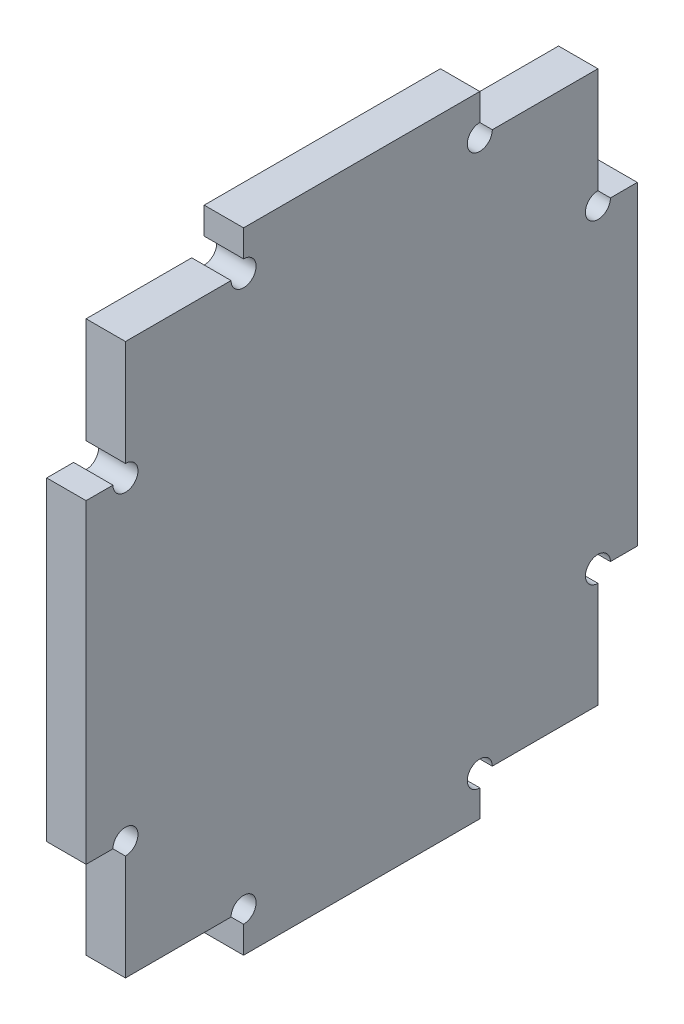
ISO-10303-21;
HEADER;
FILE_DESCRIPTION(('STEP AP214'),'2;1');
FILE_NAME('part.step','',(''),(''),'','','');
FILE_SCHEMA(('AUTOMOTIVE_DESIGN { 1 0 10303 214 1 1 1 1 }'));
ENDSEC;
DATA;
#1=APPLICATION_CONTEXT('core data for automotive mechanical design processes');
#2=APPLICATION_PROTOCOL_DEFINITION('international standard','automotive_design',2000,#1);
#3=PRODUCT_CONTEXT('',#1,'mechanical');
#4=PRODUCT('Part','Part','',(#3));
#5=PRODUCT_RELATED_PRODUCT_CATEGORY('part','',(#4));
#6=PRODUCT_DEFINITION_FORMATION('','',#4);
#7=PRODUCT_DEFINITION_CONTEXT('part definition',#1,'design');
#8=PRODUCT_DEFINITION('design','',#6,#7);
#9=PRODUCT_DEFINITION_SHAPE('','',#8);
#10=(LENGTH_UNIT() NAMED_UNIT(*) SI_UNIT(.MILLI.,.METRE.));
#11=(NAMED_UNIT(*) PLANE_ANGLE_UNIT() SI_UNIT($,.RADIAN.));
#12=(NAMED_UNIT(*) SI_UNIT($,.STERADIAN.) SOLID_ANGLE_UNIT());
#13=UNCERTAINTY_MEASURE_WITH_UNIT(LENGTH_MEASURE(1.E-05),#10,'distance_accuracy_value','');
#14=(GEOMETRIC_REPRESENTATION_CONTEXT(3) GLOBAL_UNCERTAINTY_ASSIGNED_CONTEXT((#13)) GLOBAL_UNIT_ASSIGNED_CONTEXT((#10,
#11,#12)) REPRESENTATION_CONTEXT('',''));
#15=CARTESIAN_POINT('',(0.,0.,0.));
#16=DIRECTION('',(0.,0.,1.));
#17=DIRECTION('',(1.,0.,0.));
#18=AXIS2_PLACEMENT_3D('',#15,#16,#17);
#19=CARTESIAN_POINT('',(5.,0.,0.));
#20=DIRECTION('',(-1.,0.,0.));
#21=DIRECTION('',(0.,0.,1.));
#22=AXIS2_PLACEMENT_3D('',#19,#20,#21);
#23=PLANE('',#22);
#24=DIRECTION('',(0.,-1.,0.));
#25=VECTOR('',#24,1.);
#26=CARTESIAN_POINT('',(5.,0.,15.));
#27=LINE('',#26,#25);
#28=CARTESIAN_POINT('',(5.,40.,15.));
#29=VERTEX_POINT('',#28);
#30=CARTESIAN_POINT('',(5.,36.5875,15.));
#31=VERTEX_POINT('',#30);
#32=EDGE_CURVE('E374',#29,#31,#27,.T.);
#33=ORIENTED_EDGE('',*,*,#32,.T.);
#34=CARTESIAN_POINT('',(5.,35.,15.));
#35=DIRECTION('',(1.,0.,0.));
#36=DIRECTION('',(0.,0.,-1.));
#37=AXIS2_PLACEMENT_3D('',#34,#35,#36);
#38=CIRCLE('',#37,1.5875);
#39=CARTESIAN_POINT('',(5.,35.,16.5875));
#40=VERTEX_POINT('',#39);
#41=EDGE_CURVE('E449',#40,#31,#38,.T.);
#42=ORIENTED_EDGE('',*,*,#41,.F.);
#43=DIRECTION('',(0.,0.,1.));
#44=VECTOR('',#43,1.);
#45=CARTESIAN_POINT('',(5.,35.,0.));
#46=LINE('',#45,#44);
#47=CARTESIAN_POINT('',(5.,35.,30.));
#48=VERTEX_POINT('',#47);
#49=EDGE_CURVE('E371',#40,#48,#46,.T.);
#50=ORIENTED_EDGE('',*,*,#49,.T.);
#51=DIRECTION('',(0.,-1.,0.));
#52=VECTOR('',#51,1.);
#53=CARTESIAN_POINT('',(5.,0.,30.));
#54=LINE('',#53,#52);
#55=CARTESIAN_POINT('',(5.,21.5875,30.));
#56=VERTEX_POINT('',#55);
#57=EDGE_CURVE('E367',#48,#56,#54,.T.);
#58=ORIENTED_EDGE('',*,*,#57,.T.);
#59=CARTESIAN_POINT('',(5.,20.,30.));
#60=DIRECTION('',(1.,0.,0.));
#61=DIRECTION('',(0.,0.,-1.));
#62=AXIS2_PLACEMENT_3D('',#59,#60,#61);
#63=CIRCLE('',#62,1.5875);
#64=CARTESIAN_POINT('',(5.,20.,31.5875));
#65=VERTEX_POINT('',#64);
#66=EDGE_CURVE('E441',#65,#56,#63,.T.);
#67=ORIENTED_EDGE('',*,*,#66,.F.);
#68=DIRECTION('',(0.,0.,1.));
#69=VECTOR('',#68,1.);
#70=CARTESIAN_POINT('',(5.,20.,0.));
#71=LINE('',#70,#69);
#72=CARTESIAN_POINT('',(5.,20.,35.));
#73=VERTEX_POINT('',#72);
#74=EDGE_CURVE('E357',#65,#73,#71,.T.);
#75=ORIENTED_EDGE('',*,*,#74,.T.);
#76=DIRECTION('',(0.,-1.,0.));
#77=VECTOR('',#76,1.);
#78=CARTESIAN_POINT('',(5.,-40.,35.));
#79=LINE('',#78,#77);
#80=CARTESIAN_POINT('',(5.,-20.,35.));
#81=VERTEX_POINT('',#80);
#82=EDGE_CURVE('E386',#73,#81,#79,.T.);
#83=ORIENTED_EDGE('',*,*,#82,.T.);
#84=DIRECTION('',(0.,0.,1.));
#85=VECTOR('',#84,1.);
#86=CARTESIAN_POINT('',(5.,-20.,0.));
#87=LINE('',#86,#85);
#88=CARTESIAN_POINT('',(5.,-20.,31.5875));
#89=VERTEX_POINT('',#88);
#90=EDGE_CURVE('E335',#89,#81,#87,.T.);
#91=ORIENTED_EDGE('',*,*,#90,.F.);
#92=CARTESIAN_POINT('',(5.,-20.,30.));
#93=DIRECTION('',(1.,0.,0.));
#94=DIRECTION('',(0.,0.,-1.));
#95=AXIS2_PLACEMENT_3D('',#92,#93,#94);
#96=CIRCLE('',#95,1.5875);
#97=CARTESIAN_POINT('',(5.,-21.5875,30.));
#98=VERTEX_POINT('',#97);
#99=EDGE_CURVE('E550',#98,#89,#96,.T.);
#100=ORIENTED_EDGE('',*,*,#99,.F.);
#101=DIRECTION('',(0.,1.,0.));
#102=VECTOR('',#101,1.);
#103=CARTESIAN_POINT('',(5.,0.,30.));
#104=LINE('',#103,#102);
#105=CARTESIAN_POINT('',(5.,-35.,30.));
#106=VERTEX_POINT('',#105);
#107=EDGE_CURVE('E331',#106,#98,#104,.T.);
#108=ORIENTED_EDGE('',*,*,#107,.F.);
#109=DIRECTION('',(0.,0.,1.));
#110=VECTOR('',#109,1.);
#111=CARTESIAN_POINT('',(5.,-35.,0.));
#112=LINE('',#111,#110);
#113=CARTESIAN_POINT('',(5.,-35.,16.5875));
#114=VERTEX_POINT('',#113);
#115=EDGE_CURVE('E328',#114,#106,#112,.T.);
#116=ORIENTED_EDGE('',*,*,#115,.F.);
#117=CARTESIAN_POINT('',(5.,-35.,15.));
#118=DIRECTION('',(1.,0.,0.));
#119=DIRECTION('',(0.,0.,-1.));
#120=AXIS2_PLACEMENT_3D('',#117,#118,#119);
#121=CIRCLE('',#120,1.5875);
#122=CARTESIAN_POINT('',(5.,-36.5875,15.));
#123=VERTEX_POINT('',#122);
#124=EDGE_CURVE('E544',#123,#114,#121,.T.);
#125=ORIENTED_EDGE('',*,*,#124,.F.);
#126=DIRECTION('',(0.,1.,0.));
#127=VECTOR('',#126,1.);
#128=CARTESIAN_POINT('',(5.,0.,15.));
#129=LINE('',#128,#127);
#130=CARTESIAN_POINT('',(5.,-40.,15.));
#131=VERTEX_POINT('',#130);
#132=EDGE_CURVE('E318',#131,#123,#129,.T.);
#133=ORIENTED_EDGE('',*,*,#132,.F.);
#134=DIRECTION('',(0.,0.,-1.));
#135=VECTOR('',#134,1.);
#136=CARTESIAN_POINT('',(5.,-40.,35.));
#137=LINE('',#136,#135);
#138=CARTESIAN_POINT('',(5.,-40.,-15.));
#139=VERTEX_POINT('',#138);
#140=EDGE_CURVE('E390',#131,#139,#137,.T.);
#141=ORIENTED_EDGE('',*,*,#140,.T.);
#142=DIRECTION('',(0.,1.,0.));
#143=VECTOR('',#142,1.);
#144=CARTESIAN_POINT('',(5.,0.,-15.));
#145=LINE('',#144,#143);
#146=CARTESIAN_POINT('',(5.,-36.5875,-15.));
#147=VERTEX_POINT('',#146);
#148=EDGE_CURVE('E244',#139,#147,#145,.T.);
#149=ORIENTED_EDGE('',*,*,#148,.T.);
#150=CARTESIAN_POINT('',(5.,-35.,-15.));
#151=DIRECTION('',(1.,0.,0.));
#152=DIRECTION('',(0.,0.,-1.));
#153=AXIS2_PLACEMENT_3D('',#150,#151,#152);
#154=CIRCLE('',#153,1.5875);
#155=CARTESIAN_POINT('',(5.,-35.,-16.5875));
#156=VERTEX_POINT('',#155);
#157=EDGE_CURVE('E226',#156,#147,#154,.T.);
#158=ORIENTED_EDGE('',*,*,#157,.F.);
#159=DIRECTION('',(0.,0.,-1.));
#160=VECTOR('',#159,1.);
#161=CARTESIAN_POINT('',(5.,-35.,0.));
#162=LINE('',#161,#160);
#163=CARTESIAN_POINT('',(5.,-35.,-30.));
#164=VERTEX_POINT('',#163);
#165=EDGE_CURVE('E241',#156,#164,#162,.T.);
#166=ORIENTED_EDGE('',*,*,#165,.T.);
#167=DIRECTION('',(0.,1.,0.));
#168=VECTOR('',#167,1.);
#169=CARTESIAN_POINT('',(5.,0.,-30.));
#170=LINE('',#169,#168);
#171=CARTESIAN_POINT('',(5.,-21.5875,-30.));
#172=VERTEX_POINT('',#171);
#173=EDGE_CURVE('E254',#164,#172,#170,.T.);
#174=ORIENTED_EDGE('',*,*,#173,.T.);
#175=CARTESIAN_POINT('',(5.,-20.,-30.));
#176=DIRECTION('',(1.,0.,0.));
#177=DIRECTION('',(0.,0.,-1.));
#178=AXIS2_PLACEMENT_3D('',#175,#176,#177);
#179=CIRCLE('',#178,1.5875);
#180=CARTESIAN_POINT('',(5.,-20.,-31.5875));
#181=VERTEX_POINT('',#180);
#182=EDGE_CURVE('E504',#181,#172,#179,.T.);
#183=ORIENTED_EDGE('',*,*,#182,.F.);
#184=DIRECTION('',(0.,0.,-1.));
#185=VECTOR('',#184,1.);
#186=CARTESIAN_POINT('',(5.,-20.,0.));
#187=LINE('',#186,#185);
#188=CARTESIAN_POINT('',(5.,-20.,-35.));
#189=VERTEX_POINT('',#188);
#190=EDGE_CURVE('E260',#181,#189,#187,.T.);
#191=ORIENTED_EDGE('',*,*,#190,.T.);
#192=DIRECTION('',(0.,1.,0.));
#193=VECTOR('',#192,1.);
#194=CARTESIAN_POINT('',(5.,-40.,-35.));
#195=LINE('',#194,#193);
#196=CARTESIAN_POINT('',(5.,20.,-35.));
#197=VERTEX_POINT('',#196);
#198=EDGE_CURVE('E378',#189,#197,#195,.T.);
#199=ORIENTED_EDGE('',*,*,#198,.T.);
#200=DIRECTION('',(0.,0.,-1.));
#201=VECTOR('',#200,1.);
#202=CARTESIAN_POINT('',(5.,20.,0.));
#203=LINE('',#202,#201);
#204=CARTESIAN_POINT('',(5.,20.,-31.5875));
#205=VERTEX_POINT('',#204);
#206=EDGE_CURVE('E289',#205,#197,#203,.T.);
#207=ORIENTED_EDGE('',*,*,#206,.F.);
#208=CARTESIAN_POINT('',(5.,20.,-30.));
#209=DIRECTION('',(1.,0.,0.));
#210=DIRECTION('',(0.,0.,-1.));
#211=AXIS2_PLACEMENT_3D('',#208,#209,#210);
#212=CIRCLE('',#211,1.5875);
#213=CARTESIAN_POINT('',(5.,21.5875,-30.));
#214=VERTEX_POINT('',#213);
#215=EDGE_CURVE('E523',#214,#205,#212,.T.);
#216=ORIENTED_EDGE('',*,*,#215,.F.);
#217=DIRECTION('',(0.,-1.,0.));
#218=VECTOR('',#217,1.);
#219=CARTESIAN_POINT('',(5.,0.,-30.));
#220=LINE('',#219,#218);
#221=CARTESIAN_POINT('',(5.,35.,-30.));
#222=VERTEX_POINT('',#221);
#223=EDGE_CURVE('E295',#222,#214,#220,.T.);
#224=ORIENTED_EDGE('',*,*,#223,.F.);
#225=DIRECTION('',(0.,0.,-1.));
#226=VECTOR('',#225,1.);
#227=CARTESIAN_POINT('',(5.,35.,0.));
#228=LINE('',#227,#226);
#229=CARTESIAN_POINT('',(5.,35.,-16.5875));
#230=VERTEX_POINT('',#229);
#231=EDGE_CURVE('E292',#230,#222,#228,.T.);
#232=ORIENTED_EDGE('',*,*,#231,.F.);
#233=CARTESIAN_POINT('',(5.,35.,-15.));
#234=DIRECTION('',(1.,0.,0.));
#235=DIRECTION('',(0.,0.,-1.));
#236=AXIS2_PLACEMENT_3D('',#233,#234,#235);
#237=CIRCLE('',#236,1.5875);
#238=CARTESIAN_POINT('',(5.,36.5875,-15.));
#239=VERTEX_POINT('',#238);
#240=EDGE_CURVE('E522',#239,#230,#237,.T.);
#241=ORIENTED_EDGE('',*,*,#240,.F.);
#242=DIRECTION('',(0.,-1.,0.));
#243=VECTOR('',#242,1.);
#244=CARTESIAN_POINT('',(5.,0.,-15.));
#245=LINE('',#244,#243);
#246=CARTESIAN_POINT('',(5.,40.,-15.));
#247=VERTEX_POINT('',#246);
#248=EDGE_CURVE('E279',#247,#239,#245,.T.);
#249=ORIENTED_EDGE('',*,*,#248,.F.);
#250=DIRECTION('',(0.,0.,1.));
#251=VECTOR('',#250,1.);
#252=CARTESIAN_POINT('',(5.,40.,35.));
#253=LINE('',#252,#251);
#254=EDGE_CURVE('E382',#247,#29,#253,.T.);
#255=ORIENTED_EDGE('',*,*,#254,.T.);
#256=EDGE_LOOP('',(#33,#42,#50,#58,#67,#75,#83,#91,#100,#108,#116,#125,#133,#141,#149,#158,#166,
#174,#183,#191,#199,#207,#216,#224,#232,#241,#249,#255));
#257=FACE_BOUND('',#256,.T.);
#258=ADVANCED_FACE('F39',(#257),#23,.F.);
#259=CARTESIAN_POINT('',(0.,0.,0.));
#260=DIRECTION('',(-1.,0.,0.));
#261=DIRECTION('',(0.,0.,1.));
#262=AXIS2_PLACEMENT_3D('',#259,#260,#261);
#263=PLANE('',#262);
#264=CARTESIAN_POINT('',(0.,35.,15.));
#265=DIRECTION('',(1.,0.,0.));
#266=DIRECTION('',(0.,0.,-1.));
#267=AXIS2_PLACEMENT_3D('',#264,#265,#266);
#268=CIRCLE('',#267,1.5875);
#269=CARTESIAN_POINT('',(0.,35.,16.5875));
#270=VERTEX_POINT('',#269);
#271=CARTESIAN_POINT('',(0.,36.5875,15.));
#272=VERTEX_POINT('',#271);
#273=EDGE_CURVE('E55',#270,#272,#268,.T.);
#274=ORIENTED_EDGE('',*,*,#273,.T.);
#275=DIRECTION('',(0.,1.,0.));
#276=VECTOR('',#275,1.);
#277=CARTESIAN_POINT('',(0.,35.,15.));
#278=LINE('',#277,#276);
#279=CARTESIAN_POINT('',(0.,40.,15.));
#280=VERTEX_POINT('',#279);
#281=EDGE_CURVE('E349',#272,#280,#278,.T.);
#282=ORIENTED_EDGE('',*,*,#281,.T.);
#283=DIRECTION('',(0.,0.,1.));
#284=VECTOR('',#283,1.);
#285=CARTESIAN_POINT('',(0.,40.,35.));
#286=LINE('',#285,#284);
#287=CARTESIAN_POINT('',(0.,40.,-15.));
#288=VERTEX_POINT('',#287);
#289=EDGE_CURVE('E396',#288,#280,#286,.T.);
#290=ORIENTED_EDGE('',*,*,#289,.F.);
#291=DIRECTION('',(0.,1.,0.));
#292=VECTOR('',#291,1.);
#293=CARTESIAN_POINT('',(0.,35.,-15.));
#294=LINE('',#293,#292);
#295=CARTESIAN_POINT('',(0.,36.5875,-15.));
#296=VERTEX_POINT('',#295);
#297=EDGE_CURVE('E253',#296,#288,#294,.T.);
#298=ORIENTED_EDGE('',*,*,#297,.F.);
#299=CARTESIAN_POINT('',(0.,35.,-15.));
#300=DIRECTION('',(1.,0.,0.));
#301=DIRECTION('',(0.,0.,-1.));
#302=AXIS2_PLACEMENT_3D('',#299,#300,#301);
#303=CIRCLE('',#302,1.5875);
#304=CARTESIAN_POINT('',(0.,35.,-16.5875));
#305=VERTEX_POINT('',#304);
#306=EDGE_CURVE('E527',#296,#305,#303,.T.);
#307=ORIENTED_EDGE('',*,*,#306,.T.);
#308=DIRECTION('',(0.,0.,1.));
#309=VECTOR('',#308,1.);
#310=CARTESIAN_POINT('',(0.,35.,-30.));
#311=LINE('',#310,#309);
#312=CARTESIAN_POINT('',(0.,35.,-30.));
#313=VERTEX_POINT('',#312);
#314=EDGE_CURVE('E258',#313,#305,#311,.T.);
#315=ORIENTED_EDGE('',*,*,#314,.F.);
#316=DIRECTION('',(0.,1.,0.));
#317=VECTOR('',#316,1.);
#318=CARTESIAN_POINT('',(0.,20.,-30.));
#319=LINE('',#318,#317);
#320=CARTESIAN_POINT('',(0.,21.5875,-30.));
#321=VERTEX_POINT('',#320);
#322=EDGE_CURVE('E267',#321,#313,#319,.T.);
#323=ORIENTED_EDGE('',*,*,#322,.F.);
#324=CARTESIAN_POINT('',(0.,20.,-30.));
#325=DIRECTION('',(1.,0.,0.));
#326=DIRECTION('',(0.,0.,-1.));
#327=AXIS2_PLACEMENT_3D('',#324,#325,#326);
#328=CIRCLE('',#327,1.5875);
#329=CARTESIAN_POINT('',(0.,20.,-31.5875));
#330=VERTEX_POINT('',#329);
#331=EDGE_CURVE('E517',#321,#330,#328,.T.);
#332=ORIENTED_EDGE('',*,*,#331,.T.);
#333=DIRECTION('',(0.,0.,1.));
#334=VECTOR('',#333,1.);
#335=CARTESIAN_POINT('',(0.,20.,-35.));
#336=LINE('',#335,#334);
#337=CARTESIAN_POINT('',(0.,20.,-35.));
#338=VERTEX_POINT('',#337);
#339=EDGE_CURVE('E270',#338,#330,#336,.T.);
#340=ORIENTED_EDGE('',*,*,#339,.F.);
#341=DIRECTION('',(0.,1.,0.));
#342=VECTOR('',#341,1.);
#343=CARTESIAN_POINT('',(0.,-40.,-35.));
#344=LINE('',#343,#342);
#345=CARTESIAN_POINT('',(0.,-20.,-35.));
#346=VERTEX_POINT('',#345);
#347=EDGE_CURVE('E377',#346,#338,#344,.T.);
#348=ORIENTED_EDGE('',*,*,#347,.F.);
#349=DIRECTION('',(0.,0.,1.));
#350=VECTOR('',#349,1.);
#351=CARTESIAN_POINT('',(0.,-20.,-35.));
#352=LINE('',#351,#350);
#353=CARTESIAN_POINT('',(0.,-20.,-31.5875));
#354=VERTEX_POINT('',#353);
#355=EDGE_CURVE('E475',#346,#354,#352,.T.);
#356=ORIENTED_EDGE('',*,*,#355,.T.);
#357=CARTESIAN_POINT('',(0.,-20.,-30.));
#358=DIRECTION('',(1.,0.,0.));
#359=DIRECTION('',(0.,0.,-1.));
#360=AXIS2_PLACEMENT_3D('',#357,#358,#359);
#361=CIRCLE('',#360,1.5875);
#362=CARTESIAN_POINT('',(0.,-21.5875,-30.));
#363=VERTEX_POINT('',#362);
#364=EDGE_CURVE('E529',#354,#363,#361,.T.);
#365=ORIENTED_EDGE('',*,*,#364,.T.);
#366=DIRECTION('',(0.,-1.,0.));
#367=VECTOR('',#366,1.);
#368=CARTESIAN_POINT('',(0.,-20.,-30.));
#369=LINE('',#368,#367);
#370=CARTESIAN_POINT('',(0.,-35.,-30.));
#371=VERTEX_POINT('',#370);
#372=EDGE_CURVE('E479',#363,#371,#369,.T.);
#373=ORIENTED_EDGE('',*,*,#372,.T.);
#374=DIRECTION('',(0.,0.,1.));
#375=VECTOR('',#374,1.);
#376=CARTESIAN_POINT('',(0.,-35.,-30.));
#377=LINE('',#376,#375);
#378=CARTESIAN_POINT('',(0.,-35.,-16.5875));
#379=VERTEX_POINT('',#378);
#380=EDGE_CURVE('E482',#371,#379,#377,.T.);
#381=ORIENTED_EDGE('',*,*,#380,.T.);
#382=CARTESIAN_POINT('',(0.,-35.,-15.));
#383=DIRECTION('',(1.,0.,0.));
#384=DIRECTION('',(0.,0.,-1.));
#385=AXIS2_PLACEMENT_3D('',#382,#383,#384);
#386=CIRCLE('',#385,1.5875);
#387=CARTESIAN_POINT('',(0.,-36.5875,-15.));
#388=VERTEX_POINT('',#387);
#389=EDGE_CURVE('E229',#379,#388,#386,.T.);
#390=ORIENTED_EDGE('',*,*,#389,.T.);
#391=DIRECTION('',(0.,-1.,0.));
#392=VECTOR('',#391,1.);
#393=CARTESIAN_POINT('',(0.,-35.,-15.));
#394=LINE('',#393,#392);
#395=CARTESIAN_POINT('',(0.,-40.,-15.));
#396=VERTEX_POINT('',#395);
#397=EDGE_CURVE('E485',#388,#396,#394,.T.);
#398=ORIENTED_EDGE('',*,*,#397,.T.);
#399=DIRECTION('',(0.,0.,-1.));
#400=VECTOR('',#399,1.);
#401=CARTESIAN_POINT('',(0.,-40.,35.));
#402=LINE('',#401,#400);
#403=CARTESIAN_POINT('',(0.,-40.,15.));
#404=VERTEX_POINT('',#403);
#405=EDGE_CURVE('E383',#404,#396,#402,.T.);
#406=ORIENTED_EDGE('',*,*,#405,.F.);
#407=DIRECTION('',(0.,-1.,0.));
#408=VECTOR('',#407,1.);
#409=CARTESIAN_POINT('',(0.,-35.,15.));
#410=LINE('',#409,#408);
#411=CARTESIAN_POINT('',(0.,-36.5875,15.));
#412=VERTEX_POINT('',#411);
#413=EDGE_CURVE('E299',#412,#404,#410,.T.);
#414=ORIENTED_EDGE('',*,*,#413,.F.);
#415=CARTESIAN_POINT('',(0.,-35.,15.));
#416=DIRECTION('',(1.,0.,0.));
#417=DIRECTION('',(0.,0.,-1.));
#418=AXIS2_PLACEMENT_3D('',#415,#416,#417);
#419=CIRCLE('',#418,1.5875);
#420=CARTESIAN_POINT('',(0.,-35.,16.5875));
#421=VERTEX_POINT('',#420);
#422=EDGE_CURVE('E246',#412,#421,#419,.T.);
#423=ORIENTED_EDGE('',*,*,#422,.T.);
#424=DIRECTION('',(0.,0.,-1.));
#425=VECTOR('',#424,1.);
#426=CARTESIAN_POINT('',(0.,-35.,30.));
#427=LINE('',#426,#425);
#428=CARTESIAN_POINT('',(0.,-35.,30.));
#429=VERTEX_POINT('',#428);
#430=EDGE_CURVE('E302',#429,#421,#427,.T.);
#431=ORIENTED_EDGE('',*,*,#430,.F.);
#432=DIRECTION('',(0.,-1.,0.));
#433=VECTOR('',#432,1.);
#434=CARTESIAN_POINT('',(0.,-20.,30.));
#435=LINE('',#434,#433);
#436=CARTESIAN_POINT('',(0.,-21.5875,30.));
#437=VERTEX_POINT('',#436);
#438=EDGE_CURVE('E306',#437,#429,#435,.T.);
#439=ORIENTED_EDGE('',*,*,#438,.F.);
#440=CARTESIAN_POINT('',(0.,-20.,30.));
#441=DIRECTION('',(1.,0.,0.));
#442=DIRECTION('',(0.,0.,-1.));
#443=AXIS2_PLACEMENT_3D('',#440,#441,#442);
#444=CIRCLE('',#443,1.5875);
#445=CARTESIAN_POINT('',(0.,-20.,31.5875));
#446=VERTEX_POINT('',#445);
#447=EDGE_CURVE('E547',#437,#446,#444,.T.);
#448=ORIENTED_EDGE('',*,*,#447,.T.);
#449=DIRECTION('',(0.,0.,-1.));
#450=VECTOR('',#449,1.);
#451=CARTESIAN_POINT('',(0.,-20.,35.));
#452=LINE('',#451,#450);
#453=CARTESIAN_POINT('',(0.,-20.,35.));
#454=VERTEX_POINT('',#453);
#455=EDGE_CURVE('E309',#454,#446,#452,.T.);
#456=ORIENTED_EDGE('',*,*,#455,.F.);
#457=DIRECTION('',(0.,-1.,0.));
#458=VECTOR('',#457,1.);
#459=CARTESIAN_POINT('',(0.,-40.,35.));
#460=LINE('',#459,#458);
#461=CARTESIAN_POINT('',(0.,20.,35.));
#462=VERTEX_POINT('',#461);
#463=EDGE_CURVE('E400',#462,#454,#460,.T.);
#464=ORIENTED_EDGE('',*,*,#463,.F.);
#465=DIRECTION('',(0.,0.,-1.));
#466=VECTOR('',#465,1.);
#467=CARTESIAN_POINT('',(0.,20.,35.));
#468=LINE('',#467,#466);
#469=CARTESIAN_POINT('',(0.,20.,31.5875));
#470=VERTEX_POINT('',#469);
#471=EDGE_CURVE('E338',#462,#470,#468,.T.);
#472=ORIENTED_EDGE('',*,*,#471,.T.);
#473=CARTESIAN_POINT('',(0.,20.,30.));
#474=DIRECTION('',(1.,0.,0.));
#475=DIRECTION('',(0.,0.,-1.));
#476=AXIS2_PLACEMENT_3D('',#473,#474,#475);
#477=CIRCLE('',#476,1.5875);
#478=CARTESIAN_POINT('',(0.,21.5875,30.));
#479=VERTEX_POINT('',#478);
#480=EDGE_CURVE('E62',#470,#479,#477,.T.);
#481=ORIENTED_EDGE('',*,*,#480,.T.);
#482=DIRECTION('',(0.,1.,0.));
#483=VECTOR('',#482,1.);
#484=CARTESIAN_POINT('',(0.,20.,30.));
#485=LINE('',#484,#483);
#486=CARTESIAN_POINT('',(0.,35.,30.));
#487=VERTEX_POINT('',#486);
#488=EDGE_CURVE('E342',#479,#487,#485,.T.);
#489=ORIENTED_EDGE('',*,*,#488,.T.);
#490=DIRECTION('',(0.,0.,-1.));
#491=VECTOR('',#490,1.);
#492=CARTESIAN_POINT('',(0.,35.,30.));
#493=LINE('',#492,#491);
#494=EDGE_CURVE('E345',#487,#270,#493,.T.);
#495=ORIENTED_EDGE('',*,*,#494,.T.);
#496=EDGE_LOOP('',(#274,#282,#290,#298,#307,#315,#323,#332,#340,#348,#356,#365,#373,#381,#390,
#398,#406,#414,#423,#431,#439,#448,#456,#464,#472,#481,#489,#495));
#497=FACE_BOUND('',#496,.T.);
#498=ADVANCED_FACE('F432',(#497),#263,.T.);
#499=CARTESIAN_POINT('',(5.,-40.,-35.));
#500=DIRECTION('',(0.,0.,1.));
#501=DIRECTION('',(1.,0.,0.));
#502=AXIS2_PLACEMENT_3D('',#499,#500,#501);
#503=PLANE('',#502);
#504=ORIENTED_EDGE('',*,*,#198,.F.);
#505=DIRECTION('',(1.,0.,0.));
#506=VECTOR('',#505,1.);
#507=CARTESIAN_POINT('',(0.,-20.,-35.));
#508=LINE('',#507,#506);
#509=EDGE_CURVE('E488',#346,#189,#508,.T.);
#510=ORIENTED_EDGE('',*,*,#509,.F.);
#511=ORIENTED_EDGE('',*,*,#347,.T.);
#512=DIRECTION('',(1.,0.,0.));
#513=VECTOR('',#512,1.);
#514=CARTESIAN_POINT('',(0.,20.,-35.));
#515=LINE('',#514,#513);
#516=EDGE_CURVE('E275',#338,#197,#515,.T.);
#517=ORIENTED_EDGE('',*,*,#516,.T.);
#518=EDGE_LOOP('',(#504,#510,#511,#517));
#519=FACE_BOUND('',#518,.T.);
#520=ADVANCED_FACE('F41',(#519),#503,.F.);
#521=CARTESIAN_POINT('',(5.,40.,35.));
#522=DIRECTION('',(0.,-1.,0.));
#523=DIRECTION('',(0.,0.,-1.));
#524=AXIS2_PLACEMENT_3D('',#521,#522,#523);
#525=PLANE('',#524);
#526=DIRECTION('',(1.,0.,0.));
#527=VECTOR('',#526,1.);
#528=CARTESIAN_POINT('',(0.,40.,-15.));
#529=LINE('',#528,#527);
#530=EDGE_CURVE('E274',#288,#247,#529,.T.);
#531=ORIENTED_EDGE('',*,*,#530,.F.);
#532=ORIENTED_EDGE('',*,*,#289,.T.);
#533=DIRECTION('',(1.,0.,0.));
#534=VECTOR('',#533,1.);
#535=CARTESIAN_POINT('',(0.,40.,15.));
#536=LINE('',#535,#534);
#537=EDGE_CURVE('E353',#280,#29,#536,.T.);
#538=ORIENTED_EDGE('',*,*,#537,.T.);
#539=ORIENTED_EDGE('',*,*,#254,.F.);
#540=EDGE_LOOP('',(#531,#532,#538,#539));
#541=FACE_BOUND('',#540,.T.);
#542=ADVANCED_FACE('F601',(#541),#525,.F.);
#543=CARTESIAN_POINT('',(5.,-40.,35.));
#544=DIRECTION('',(0.,0.,-1.));
#545=DIRECTION('',(-1.,0.,0.));
#546=AXIS2_PLACEMENT_3D('',#543,#544,#545);
#547=PLANE('',#546);
#548=DIRECTION('',(1.,0.,0.));
#549=VECTOR('',#548,1.);
#550=CARTESIAN_POINT('',(0.,-20.,35.));
#551=LINE('',#550,#549);
#552=EDGE_CURVE('E314',#454,#81,#551,.T.);
#553=ORIENTED_EDGE('',*,*,#552,.T.);
#554=ORIENTED_EDGE('',*,*,#82,.F.);
#555=DIRECTION('',(1.,0.,0.));
#556=VECTOR('',#555,1.);
#557=CARTESIAN_POINT('',(0.,20.,35.));
#558=LINE('',#557,#556);
#559=EDGE_CURVE('E352',#462,#73,#558,.T.);
#560=ORIENTED_EDGE('',*,*,#559,.F.);
#561=ORIENTED_EDGE('',*,*,#463,.T.);
#562=EDGE_LOOP('',(#553,#554,#560,#561));
#563=FACE_BOUND('',#562,.T.);
#564=ADVANCED_FACE('F437',(#563),#547,.F.);
#565=CARTESIAN_POINT('',(5.,-40.,35.));
#566=DIRECTION('',(0.,1.,0.));
#567=DIRECTION('',(0.,0.,1.));
#568=AXIS2_PLACEMENT_3D('',#565,#566,#567);
#569=PLANE('',#568);
#570=ORIENTED_EDGE('',*,*,#405,.T.);
#571=DIRECTION('',(1.,0.,0.));
#572=VECTOR('',#571,1.);
#573=CARTESIAN_POINT('',(0.,-40.,-15.));
#574=LINE('',#573,#572);
#575=EDGE_CURVE('E489',#396,#139,#574,.T.);
#576=ORIENTED_EDGE('',*,*,#575,.T.);
#577=ORIENTED_EDGE('',*,*,#140,.F.);
#578=DIRECTION('',(1.,0.,0.));
#579=VECTOR('',#578,1.);
#580=CARTESIAN_POINT('',(0.,-40.,15.));
#581=LINE('',#580,#579);
#582=EDGE_CURVE('E313',#404,#131,#581,.T.);
#583=ORIENTED_EDGE('',*,*,#582,.F.);
#584=EDGE_LOOP('',(#570,#576,#577,#583));
#585=FACE_BOUND('',#584,.T.);
#586=ADVANCED_FACE('F595',(#585),#569,.F.);
#587=CARTESIAN_POINT('',(0.,35.,15.));
#588=DIRECTION('',(0.,0.,-1.));
#589=DIRECTION('',(-1.,0.,0.));
#590=AXIS2_PLACEMENT_3D('',#587,#588,#589);
#591=PLANE('',#590);
#592=ORIENTED_EDGE('',*,*,#281,.F.);
#593=DIRECTION('',(1.,0.,0.));
#594=VECTOR('',#593,1.);
#595=CARTESIAN_POINT('',(0.,36.5875,15.));
#596=LINE('',#595,#594);
#597=EDGE_CURVE('E471',#272,#31,#596,.T.);
#598=ORIENTED_EDGE('',*,*,#597,.T.);
#599=ORIENTED_EDGE('',*,*,#32,.F.);
#600=ORIENTED_EDGE('',*,*,#537,.F.);
#601=EDGE_LOOP('',(#592,#598,#599,#600));
#602=FACE_BOUND('',#601,.T.);
#603=ADVANCED_FACE('F598',(#602),#591,.F.);
#604=CARTESIAN_POINT('',(0.,35.,30.));
#605=DIRECTION('',(0.,-1.,0.));
#606=DIRECTION('',(0.,0.,-1.));
#607=AXIS2_PLACEMENT_3D('',#604,#605,#606);
#608=PLANE('',#607);
#609=ORIENTED_EDGE('',*,*,#49,.F.);
#610=DIRECTION('',(1.,0.,0.));
#611=VECTOR('',#610,1.);
#612=CARTESIAN_POINT('',(0.,35.,16.5875));
#613=LINE('',#612,#611);
#614=EDGE_CURVE('E11',#40,#270,#613,.F.);
#615=ORIENTED_EDGE('',*,*,#614,.T.);
#616=ORIENTED_EDGE('',*,*,#494,.F.);
#617=DIRECTION('',(1.,0.,0.));
#618=VECTOR('',#617,1.);
#619=CARTESIAN_POINT('',(0.,35.,30.));
#620=LINE('',#619,#618);
#621=EDGE_CURVE('E358',#487,#48,#620,.T.);
#622=ORIENTED_EDGE('',*,*,#621,.T.);
#623=EDGE_LOOP('',(#609,#615,#616,#622));
#624=FACE_BOUND('',#623,.T.);
#625=ADVANCED_FACE('F648',(#624),#608,.F.);
#626=CARTESIAN_POINT('',(0.,20.,30.));
#627=DIRECTION('',(0.,0.,-1.));
#628=DIRECTION('',(-1.,0.,0.));
#629=AXIS2_PLACEMENT_3D('',#626,#627,#628);
#630=PLANE('',#629);
#631=ORIENTED_EDGE('',*,*,#488,.F.);
#632=DIRECTION('',(1.,0.,0.));
#633=VECTOR('',#632,1.);
#634=CARTESIAN_POINT('',(0.,21.5875,30.));
#635=LINE('',#634,#633);
#636=EDGE_CURVE('E468',#479,#56,#635,.T.);
#637=ORIENTED_EDGE('',*,*,#636,.T.);
#638=ORIENTED_EDGE('',*,*,#57,.F.);
#639=ORIENTED_EDGE('',*,*,#621,.F.);
#640=EDGE_LOOP('',(#631,#637,#638,#639));
#641=FACE_BOUND('',#640,.T.);
#642=ADVANCED_FACE('F650',(#641),#630,.F.);
#643=CARTESIAN_POINT('',(0.,20.,35.));
#644=DIRECTION('',(0.,-1.,0.));
#645=DIRECTION('',(0.,0.,-1.));
#646=AXIS2_PLACEMENT_3D('',#643,#644,#645);
#647=PLANE('',#646);
#648=ORIENTED_EDGE('',*,*,#74,.F.);
#649=DIRECTION('',(1.,0.,0.));
#650=VECTOR('',#649,1.);
#651=CARTESIAN_POINT('',(0.,20.,31.5875));
#652=LINE('',#651,#650);
#653=EDGE_CURVE('E48',#65,#470,#652,.F.);
#654=ORIENTED_EDGE('',*,*,#653,.T.);
#655=ORIENTED_EDGE('',*,*,#471,.F.);
#656=ORIENTED_EDGE('',*,*,#559,.T.);
#657=EDGE_LOOP('',(#648,#654,#655,#656));
#658=FACE_BOUND('',#657,.T.);
#659=ADVANCED_FACE('F427',(#658),#647,.F.);
#660=CARTESIAN_POINT('',(0.,-20.,35.));
#661=DIRECTION('',(0.,-1.,0.));
#662=DIRECTION('',(0.,0.,-1.));
#663=AXIS2_PLACEMENT_3D('',#660,#661,#662);
#664=PLANE('',#663);
#665=DIRECTION('',(1.,0.,0.));
#666=VECTOR('',#665,1.);
#667=CARTESIAN_POINT('',(0.,-20.,31.5875));
#668=LINE('',#667,#666);
#669=EDGE_CURVE('E465',#89,#446,#668,.F.);
#670=ORIENTED_EDGE('',*,*,#669,.F.);
#671=ORIENTED_EDGE('',*,*,#90,.T.);
#672=ORIENTED_EDGE('',*,*,#552,.F.);
#673=ORIENTED_EDGE('',*,*,#455,.T.);
#674=EDGE_LOOP('',(#670,#671,#672,#673));
#675=FACE_BOUND('',#674,.T.);
#676=ADVANCED_FACE('F630',(#675),#664,.T.);
#677=CARTESIAN_POINT('',(0.,-20.,30.));
#678=DIRECTION('',(0.,0.,1.));
#679=DIRECTION('',(1.,0.,0.));
#680=AXIS2_PLACEMENT_3D('',#677,#678,#679);
#681=PLANE('',#680);
#682=DIRECTION('',(1.,0.,0.));
#683=VECTOR('',#682,1.);
#684=CARTESIAN_POINT('',(0.,-21.5875,30.));
#685=LINE('',#684,#683);
#686=EDGE_CURVE('E422',#437,#98,#685,.T.);
#687=ORIENTED_EDGE('',*,*,#686,.F.);
#688=ORIENTED_EDGE('',*,*,#438,.T.);
#689=DIRECTION('',(1.,0.,0.));
#690=VECTOR('',#689,1.);
#691=CARTESIAN_POINT('',(0.,-35.,30.));
#692=LINE('',#691,#690);
#693=EDGE_CURVE('E319',#429,#106,#692,.T.);
#694=ORIENTED_EDGE('',*,*,#693,.T.);
#695=ORIENTED_EDGE('',*,*,#107,.T.);
#696=EDGE_LOOP('',(#687,#688,#694,#695));
#697=FACE_BOUND('',#696,.T.);
#698=ADVANCED_FACE('F633',(#697),#681,.T.);
#699=CARTESIAN_POINT('',(0.,-35.,30.));
#700=DIRECTION('',(0.,-1.,0.));
#701=DIRECTION('',(0.,0.,-1.));
#702=AXIS2_PLACEMENT_3D('',#699,#700,#701);
#703=PLANE('',#702);
#704=DIRECTION('',(1.,0.,0.));
#705=VECTOR('',#704,1.);
#706=CARTESIAN_POINT('',(0.,-35.,16.5875));
#707=LINE('',#706,#705);
#708=EDGE_CURVE('E462',#114,#421,#707,.F.);
#709=ORIENTED_EDGE('',*,*,#708,.F.);
#710=ORIENTED_EDGE('',*,*,#115,.T.);
#711=ORIENTED_EDGE('',*,*,#693,.F.);
#712=ORIENTED_EDGE('',*,*,#430,.T.);
#713=EDGE_LOOP('',(#709,#710,#711,#712));
#714=FACE_BOUND('',#713,.T.);
#715=ADVANCED_FACE('F637',(#714),#703,.T.);
#716=CARTESIAN_POINT('',(0.,-35.,15.));
#717=DIRECTION('',(0.,0.,1.));
#718=DIRECTION('',(1.,0.,0.));
#719=AXIS2_PLACEMENT_3D('',#716,#717,#718);
#720=PLANE('',#719);
#721=DIRECTION('',(1.,0.,0.));
#722=VECTOR('',#721,1.);
#723=CARTESIAN_POINT('',(0.,-36.5875,15.));
#724=LINE('',#723,#722);
#725=EDGE_CURVE('E419',#412,#123,#724,.T.);
#726=ORIENTED_EDGE('',*,*,#725,.F.);
#727=ORIENTED_EDGE('',*,*,#413,.T.);
#728=ORIENTED_EDGE('',*,*,#582,.T.);
#729=ORIENTED_EDGE('',*,*,#132,.T.);
#730=EDGE_LOOP('',(#726,#727,#728,#729));
#731=FACE_BOUND('',#730,.T.);
#732=ADVANCED_FACE('F641',(#731),#720,.T.);
#733=CARTESIAN_POINT('',(0.,20.,-30.));
#734=DIRECTION('',(0.,0.,-1.));
#735=DIRECTION('',(-1.,0.,0.));
#736=AXIS2_PLACEMENT_3D('',#733,#734,#735);
#737=PLANE('',#736);
#738=DIRECTION('',(1.,0.,0.));
#739=VECTOR('',#738,1.);
#740=CARTESIAN_POINT('',(0.,21.5875,-30.));
#741=LINE('',#740,#739);
#742=EDGE_CURVE('E459',#321,#214,#741,.T.);
#743=ORIENTED_EDGE('',*,*,#742,.F.);
#744=ORIENTED_EDGE('',*,*,#322,.T.);
#745=DIRECTION('',(1.,0.,0.));
#746=VECTOR('',#745,1.);
#747=CARTESIAN_POINT('',(0.,35.,-30.));
#748=LINE('',#747,#746);
#749=EDGE_CURVE('E280',#313,#222,#748,.T.);
#750=ORIENTED_EDGE('',*,*,#749,.T.);
#751=ORIENTED_EDGE('',*,*,#223,.T.);
#752=EDGE_LOOP('',(#743,#744,#750,#751));
#753=FACE_BOUND('',#752,.T.);
#754=ADVANCED_FACE('F567',(#753),#737,.T.);
#755=CARTESIAN_POINT('',(0.,35.,-30.));
#756=DIRECTION('',(0.,1.,0.));
#757=DIRECTION('',(0.,0.,1.));
#758=AXIS2_PLACEMENT_3D('',#755,#756,#757);
#759=PLANE('',#758);
#760=DIRECTION('',(1.,0.,0.));
#761=VECTOR('',#760,1.);
#762=CARTESIAN_POINT('',(0.,35.,-16.5875));
#763=LINE('',#762,#761);
#764=EDGE_CURVE('E456',#230,#305,#763,.F.);
#765=ORIENTED_EDGE('',*,*,#764,.F.);
#766=ORIENTED_EDGE('',*,*,#231,.T.);
#767=ORIENTED_EDGE('',*,*,#749,.F.);
#768=ORIENTED_EDGE('',*,*,#314,.T.);
#769=EDGE_LOOP('',(#765,#766,#767,#768));
#770=FACE_BOUND('',#769,.T.);
#771=ADVANCED_FACE('F563',(#770),#759,.T.);
#772=CARTESIAN_POINT('',(0.,20.,-35.));
#773=DIRECTION('',(0.,1.,0.));
#774=DIRECTION('',(0.,0.,1.));
#775=AXIS2_PLACEMENT_3D('',#772,#773,#774);
#776=PLANE('',#775);
#777=DIRECTION('',(1.,0.,0.));
#778=VECTOR('',#777,1.);
#779=CARTESIAN_POINT('',(0.,20.,-31.5875));
#780=LINE('',#779,#778);
#781=EDGE_CURVE('E416',#205,#330,#780,.F.);
#782=ORIENTED_EDGE('',*,*,#781,.F.);
#783=ORIENTED_EDGE('',*,*,#206,.T.);
#784=ORIENTED_EDGE('',*,*,#516,.F.);
#785=ORIENTED_EDGE('',*,*,#339,.T.);
#786=EDGE_LOOP('',(#782,#783,#784,#785));
#787=FACE_BOUND('',#786,.T.);
#788=ADVANCED_FACE('F514',(#787),#776,.T.);
#789=CARTESIAN_POINT('',(0.,35.,-15.));
#790=DIRECTION('',(0.,0.,-1.));
#791=DIRECTION('',(-1.,0.,0.));
#792=AXIS2_PLACEMENT_3D('',#789,#790,#791);
#793=PLANE('',#792);
#794=DIRECTION('',(1.,0.,0.));
#795=VECTOR('',#794,1.);
#796=CARTESIAN_POINT('',(0.,36.5875,-15.));
#797=LINE('',#796,#795);
#798=EDGE_CURVE('E413',#296,#239,#797,.T.);
#799=ORIENTED_EDGE('',*,*,#798,.F.);
#800=ORIENTED_EDGE('',*,*,#297,.T.);
#801=ORIENTED_EDGE('',*,*,#530,.T.);
#802=ORIENTED_EDGE('',*,*,#248,.T.);
#803=EDGE_LOOP('',(#799,#800,#801,#802));
#804=FACE_BOUND('',#803,.T.);
#805=ADVANCED_FACE('F617',(#804),#793,.T.);
#806=CARTESIAN_POINT('',(0.,-35.,-30.));
#807=DIRECTION('',(0.,1.,0.));
#808=DIRECTION('',(0.,0.,1.));
#809=AXIS2_PLACEMENT_3D('',#806,#807,#808);
#810=PLANE('',#809);
#811=ORIENTED_EDGE('',*,*,#165,.F.);
#812=DIRECTION('',(1.,0.,0.));
#813=VECTOR('',#812,1.);
#814=CARTESIAN_POINT('',(0.,-35.,-16.5875));
#815=LINE('',#814,#813);
#816=EDGE_CURVE('E223',#156,#379,#815,.F.);
#817=ORIENTED_EDGE('',*,*,#816,.T.);
#818=ORIENTED_EDGE('',*,*,#380,.F.);
#819=DIRECTION('',(1.,0.,0.));
#820=VECTOR('',#819,1.);
#821=CARTESIAN_POINT('',(0.,-35.,-30.));
#822=LINE('',#821,#820);
#823=EDGE_CURVE('E251',#371,#164,#822,.T.);
#824=ORIENTED_EDGE('',*,*,#823,.T.);
#825=EDGE_LOOP('',(#811,#817,#818,#824));
#826=FACE_BOUND('',#825,.T.);
#827=ADVANCED_FACE('F249',(#826),#810,.F.);
#828=CARTESIAN_POINT('',(0.,-20.,-30.));
#829=DIRECTION('',(0.,0.,1.));
#830=DIRECTION('',(1.,0.,0.));
#831=AXIS2_PLACEMENT_3D('',#828,#829,#830);
#832=PLANE('',#831);
#833=ORIENTED_EDGE('',*,*,#372,.F.);
#834=DIRECTION('',(1.,0.,0.));
#835=VECTOR('',#834,1.);
#836=CARTESIAN_POINT('',(0.,-21.5875,-30.));
#837=LINE('',#836,#835);
#838=EDGE_CURVE('E235',#363,#172,#837,.T.);
#839=ORIENTED_EDGE('',*,*,#838,.T.);
#840=ORIENTED_EDGE('',*,*,#173,.F.);
#841=ORIENTED_EDGE('',*,*,#823,.F.);
#842=EDGE_LOOP('',(#833,#839,#840,#841));
#843=FACE_BOUND('',#842,.T.);
#844=ADVANCED_FACE('F624',(#843),#832,.F.);
#845=CARTESIAN_POINT('',(0.,-20.,-35.));
#846=DIRECTION('',(0.,1.,0.));
#847=DIRECTION('',(0.,0.,1.));
#848=AXIS2_PLACEMENT_3D('',#845,#846,#847);
#849=PLANE('',#848);
#850=ORIENTED_EDGE('',*,*,#190,.F.);
#851=DIRECTION('',(1.,0.,0.));
#852=VECTOR('',#851,1.);
#853=CARTESIAN_POINT('',(0.,-20.,-31.5875));
#854=LINE('',#853,#852);
#855=EDGE_CURVE('E409',#181,#354,#854,.F.);
#856=ORIENTED_EDGE('',*,*,#855,.T.);
#857=ORIENTED_EDGE('',*,*,#355,.F.);
#858=ORIENTED_EDGE('',*,*,#509,.T.);
#859=EDGE_LOOP('',(#850,#856,#857,#858));
#860=FACE_BOUND('',#859,.T.);
#861=ADVANCED_FACE('F507',(#860),#849,.F.);
#862=CARTESIAN_POINT('',(0.,-35.,-15.));
#863=DIRECTION('',(0.,0.,1.));
#864=DIRECTION('',(1.,0.,0.));
#865=AXIS2_PLACEMENT_3D('',#862,#863,#864);
#866=PLANE('',#865);
#867=ORIENTED_EDGE('',*,*,#397,.F.);
#868=DIRECTION('',(1.,0.,0.));
#869=VECTOR('',#868,1.);
#870=CARTESIAN_POINT('',(0.,-36.5875,-15.));
#871=LINE('',#870,#869);
#872=EDGE_CURVE('E393',#388,#147,#871,.T.);
#873=ORIENTED_EDGE('',*,*,#872,.T.);
#874=ORIENTED_EDGE('',*,*,#148,.F.);
#875=ORIENTED_EDGE('',*,*,#575,.F.);
#876=EDGE_LOOP('',(#867,#873,#874,#875));
#877=FACE_BOUND('',#876,.T.);
#878=ADVANCED_FACE('F672',(#877),#866,.F.);
#879=CARTESIAN_POINT('',(0.,-35.,-15.));
#880=DIRECTION('',(1.,0.,0.));
#881=DIRECTION('',(0.,0.,-1.));
#882=AXIS2_PLACEMENT_3D('',#879,#880,#881);
#883=CYLINDRICAL_SURFACE('',#882,1.5875);
#884=ORIENTED_EDGE('',*,*,#157,.T.);
#885=ORIENTED_EDGE('',*,*,#872,.F.);
#886=ORIENTED_EDGE('',*,*,#389,.F.);
#887=ORIENTED_EDGE('',*,*,#816,.F.);
#888=EDGE_LOOP('',(#884,#885,#886,#887));
#889=FACE_BOUND('',#888,.T.);
#890=ADVANCED_FACE('F225',(#889),#883,.F.);
#891=CARTESIAN_POINT('',(0.,-20.,-30.));
#892=DIRECTION('',(1.,0.,0.));
#893=DIRECTION('',(0.,0.,-1.));
#894=AXIS2_PLACEMENT_3D('',#891,#892,#893);
#895=CYLINDRICAL_SURFACE('',#894,1.5875);
#896=ORIENTED_EDGE('',*,*,#364,.F.);
#897=ORIENTED_EDGE('',*,*,#855,.F.);
#898=ORIENTED_EDGE('',*,*,#182,.T.);
#899=ORIENTED_EDGE('',*,*,#838,.F.);
#900=EDGE_LOOP('',(#896,#897,#898,#899));
#901=FACE_BOUND('',#900,.T.);
#902=ADVANCED_FACE('F582',(#901),#895,.F.);
#903=CARTESIAN_POINT('',(0.,35.,-15.));
#904=DIRECTION('',(1.,0.,0.));
#905=DIRECTION('',(0.,0.,-1.));
#906=AXIS2_PLACEMENT_3D('',#903,#904,#905);
#907=CYLINDRICAL_SURFACE('',#906,1.5875);
#908=ORIENTED_EDGE('',*,*,#764,.T.);
#909=ORIENTED_EDGE('',*,*,#306,.F.);
#910=ORIENTED_EDGE('',*,*,#798,.T.);
#911=ORIENTED_EDGE('',*,*,#240,.T.);
#912=EDGE_LOOP('',(#908,#909,#910,#911));
#913=FACE_BOUND('',#912,.T.);
#914=ADVANCED_FACE('F573',(#913),#907,.F.);
#915=CARTESIAN_POINT('',(0.,20.,-30.));
#916=DIRECTION('',(1.,0.,0.));
#917=DIRECTION('',(0.,0.,-1.));
#918=AXIS2_PLACEMENT_3D('',#915,#916,#917);
#919=CYLINDRICAL_SURFACE('',#918,1.5875);
#920=ORIENTED_EDGE('',*,*,#742,.T.);
#921=ORIENTED_EDGE('',*,*,#215,.T.);
#922=ORIENTED_EDGE('',*,*,#781,.T.);
#923=ORIENTED_EDGE('',*,*,#331,.F.);
#924=EDGE_LOOP('',(#920,#921,#922,#923));
#925=FACE_BOUND('',#924,.T.);
#926=ADVANCED_FACE('F570',(#925),#919,.F.);
#927=CARTESIAN_POINT('',(0.,-35.,15.));
#928=DIRECTION('',(1.,0.,0.));
#929=DIRECTION('',(0.,0.,-1.));
#930=AXIS2_PLACEMENT_3D('',#927,#928,#929);
#931=CYLINDRICAL_SURFACE('',#930,1.5875);
#932=ORIENTED_EDGE('',*,*,#708,.T.);
#933=ORIENTED_EDGE('',*,*,#422,.F.);
#934=ORIENTED_EDGE('',*,*,#725,.T.);
#935=ORIENTED_EDGE('',*,*,#124,.T.);
#936=EDGE_LOOP('',(#932,#933,#934,#935));
#937=FACE_BOUND('',#936,.T.);
#938=ADVANCED_FACE('F572',(#937),#931,.F.);
#939=CARTESIAN_POINT('',(0.,-20.,30.));
#940=DIRECTION('',(1.,0.,0.));
#941=DIRECTION('',(0.,0.,-1.));
#942=AXIS2_PLACEMENT_3D('',#939,#940,#941);
#943=CYLINDRICAL_SURFACE('',#942,1.5875);
#944=ORIENTED_EDGE('',*,*,#669,.T.);
#945=ORIENTED_EDGE('',*,*,#447,.F.);
#946=ORIENTED_EDGE('',*,*,#686,.T.);
#947=ORIENTED_EDGE('',*,*,#99,.T.);
#948=EDGE_LOOP('',(#944,#945,#946,#947));
#949=FACE_BOUND('',#948,.T.);
#950=ADVANCED_FACE('F579',(#949),#943,.F.);
#951=CARTESIAN_POINT('',(0.,20.,30.));
#952=DIRECTION('',(1.,0.,0.));
#953=DIRECTION('',(0.,0.,-1.));
#954=AXIS2_PLACEMENT_3D('',#951,#952,#953);
#955=CYLINDRICAL_SURFACE('',#954,1.5875);
#956=ORIENTED_EDGE('',*,*,#480,.F.);
#957=ORIENTED_EDGE('',*,*,#653,.F.);
#958=ORIENTED_EDGE('',*,*,#66,.T.);
#959=ORIENTED_EDGE('',*,*,#636,.F.);
#960=EDGE_LOOP('',(#956,#957,#958,#959));
#961=FACE_BOUND('',#960,.T.);
#962=ADVANCED_FACE('F661',(#961),#955,.F.);
#963=CARTESIAN_POINT('',(0.,35.,15.));
#964=DIRECTION('',(1.,0.,0.));
#965=DIRECTION('',(0.,0.,-1.));
#966=AXIS2_PLACEMENT_3D('',#963,#964,#965);
#967=CYLINDRICAL_SURFACE('',#966,1.5875);
#968=ORIENTED_EDGE('',*,*,#273,.F.);
#969=ORIENTED_EDGE('',*,*,#614,.F.);
#970=ORIENTED_EDGE('',*,*,#41,.T.);
#971=ORIENTED_EDGE('',*,*,#597,.F.);
#972=EDGE_LOOP('',(#968,#969,#970,#971));
#973=FACE_BOUND('',#972,.T.);
#974=ADVANCED_FACE('F659',(#973),#967,.F.);
#975=CLOSED_SHELL('',(#258,#498,#520,#542,#564,#586,#603,#625,#642,#659,#676,#698,#715,#732,
#754,#771,#788,#805,#827,#844,#861,#878,#890,#902,#914,#926,#938,#950,#962,#974));
#976=MANIFOLD_SOLID_BREP('B2',#975);
#977=ADVANCED_BREP_SHAPE_REPRESENTATION('',(#18,#976),#14);
#978=SHAPE_DEFINITION_REPRESENTATION(#9,#977);
ENDSEC;
END-ISO-10303-21;
